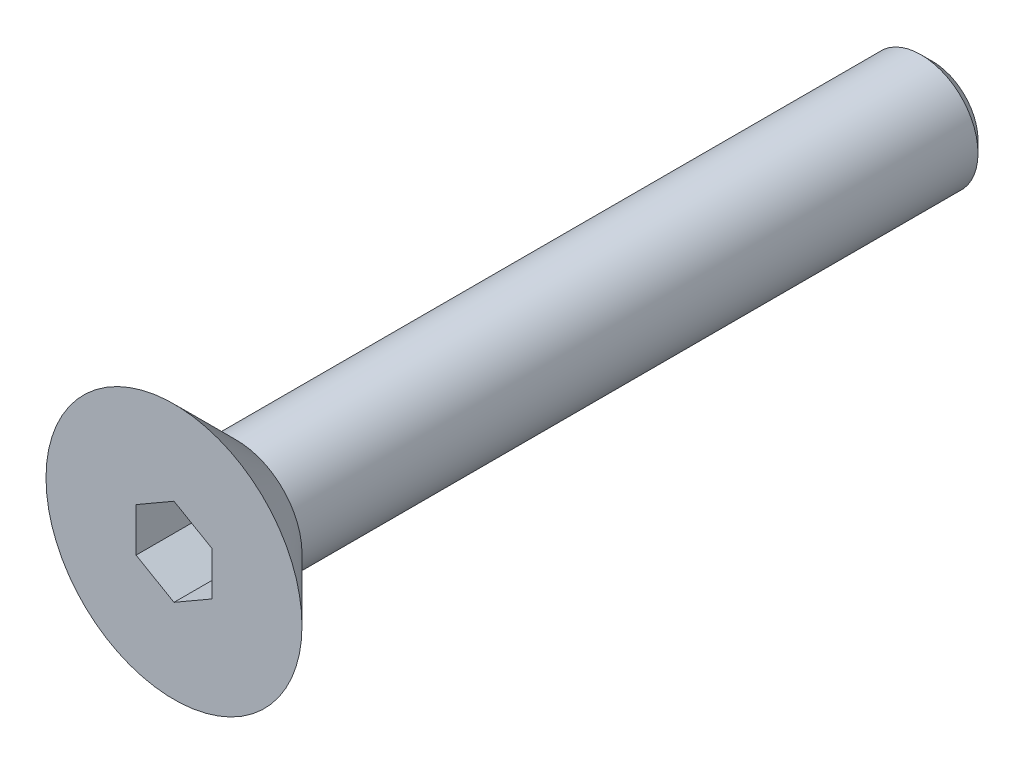
ISO-10303-21;
HEADER;
FILE_DESCRIPTION(('STEP AP214'),'2;1');
FILE_NAME('part.step','',(''),(''),'','','');
FILE_SCHEMA(('AUTOMOTIVE_DESIGN { 1 0 10303 214 1 1 1 1 }'));
ENDSEC;
DATA;
#1=APPLICATION_CONTEXT('core data for automotive mechanical design processes');
#2=APPLICATION_PROTOCOL_DEFINITION('international standard','automotive_design',2000,#1);
#3=PRODUCT_CONTEXT('',#1,'mechanical');
#4=PRODUCT('Part','Part','',(#3));
#5=PRODUCT_RELATED_PRODUCT_CATEGORY('part','',(#4));
#6=PRODUCT_DEFINITION_FORMATION('','',#4);
#7=PRODUCT_DEFINITION_CONTEXT('part definition',#1,'design');
#8=PRODUCT_DEFINITION('design','',#6,#7);
#9=PRODUCT_DEFINITION_SHAPE('','',#8);
#10=(LENGTH_UNIT() NAMED_UNIT(*) SI_UNIT(.MILLI.,.METRE.));
#11=(NAMED_UNIT(*) PLANE_ANGLE_UNIT() SI_UNIT($,.RADIAN.));
#12=(NAMED_UNIT(*) SI_UNIT($,.STERADIAN.) SOLID_ANGLE_UNIT());
#13=UNCERTAINTY_MEASURE_WITH_UNIT(LENGTH_MEASURE(1.E-05),#10,'distance_accuracy_value','');
#14=(GEOMETRIC_REPRESENTATION_CONTEXT(3) GLOBAL_UNCERTAINTY_ASSIGNED_CONTEXT((#13)) GLOBAL_UNIT_ASSIGNED_CONTEXT((#10,
#11,#12)) REPRESENTATION_CONTEXT('',''));
#15=CARTESIAN_POINT('',(0.,0.,0.));
#16=DIRECTION('',(0.,0.,1.));
#17=DIRECTION('',(1.,0.,0.));
#18=AXIS2_PLACEMENT_3D('',#15,#16,#17);
#19=CARTESIAN_POINT('',(0.,0.,0.));
#20=DIRECTION('',(0.,0.,1.));
#21=DIRECTION('',(1.,0.,0.));
#22=AXIS2_PLACEMENT_3D('',#19,#20,#21);
#23=PLANE('',#22);
#24=CARTESIAN_POINT('',(0.,0.,0.));
#25=DIRECTION('',(0.,0.,1.));
#26=DIRECTION('',(1.,0.,0.));
#27=AXIS2_PLACEMENT_3D('',#24,#25,#26);
#28=CIRCLE('',#27,1.725);
#29=CARTESIAN_POINT('',(1.725,0.,0.));
#30=VERTEX_POINT('',#29);
#31=EDGE_CURVE('E11',#30,#30,#28,.F.);
#32=ORIENTED_EDGE('',*,*,#31,.T.);
#33=EDGE_LOOP('',(#32));
#34=FACE_BOUND('',#33,.T.);
#35=CARTESIAN_POINT('',(0.,0.,0.));
#36=DIRECTION('',(0.,0.,1.));
#37=DIRECTION('',(1.,0.,0.));
#38=AXIS2_PLACEMENT_3D('',#35,#36,#37);
#39=CIRCLE('',#38,1.5);
#40=CARTESIAN_POINT('',(1.5,0.,0.));
#41=VERTEX_POINT('',#40);
#42=EDGE_CURVE('E144',#41,#41,#39,.F.);
#43=ORIENTED_EDGE('',*,*,#42,.F.);
#44=EDGE_LOOP('',(#43));
#45=FACE_BOUND('',#44,.T.);
#46=ADVANCED_FACE('F34',(#34,#45),#23,.F.);
#47=CARTESIAN_POINT('',(0.,0.,1.65));
#48=DIRECTION('',(0.,0.,1.));
#49=DIRECTION('',(1.,0.,0.));
#50=AXIS2_PLACEMENT_3D('',#47,#48,#49);
#51=PLANE('',#50);
#52=DIRECTION('',(-0.866025403784439,0.5,0.));
#53=VECTOR('',#52,1.);
#54=CARTESIAN_POINT('',(1.,0.577350269189626,1.65));
#55=LINE('',#54,#53);
#56=CARTESIAN_POINT('',(1.,0.577350269189626,1.65));
#57=VERTEX_POINT('',#56);
#58=CARTESIAN_POINT('',(0.,1.15470053837925,1.65));
#59=VERTEX_POINT('',#58);
#60=EDGE_CURVE('E49',#57,#59,#55,.T.);
#61=ORIENTED_EDGE('',*,*,#60,.F.);
#62=DIRECTION('',(0.,1.,0.));
#63=VECTOR('',#62,1.);
#64=CARTESIAN_POINT('',(1.,-0.577350269189626,1.65));
#65=LINE('',#64,#63);
#66=CARTESIAN_POINT('',(1.,-0.577350269189626,1.65));
#67=VERTEX_POINT('',#66);
#68=EDGE_CURVE('E132',#67,#57,#65,.T.);
#69=ORIENTED_EDGE('',*,*,#68,.F.);
#70=DIRECTION('',(0.866025403784439,0.5,0.));
#71=VECTOR('',#70,1.);
#72=CARTESIAN_POINT('',(0.,-1.15470053837925,1.65));
#73=LINE('',#72,#71);
#74=CARTESIAN_POINT('',(0.,-1.15470053837925,1.65));
#75=VERTEX_POINT('',#74);
#76=EDGE_CURVE('E130',#75,#67,#73,.T.);
#77=ORIENTED_EDGE('',*,*,#76,.F.);
#78=DIRECTION('',(0.866025403784439,-0.5,0.));
#79=VECTOR('',#78,1.);
#80=CARTESIAN_POINT('',(-1.,-0.577350269189626,1.65));
#81=LINE('',#80,#79);
#82=CARTESIAN_POINT('',(-1.,-0.577350269189626,1.65));
#83=VERTEX_POINT('',#82);
#84=EDGE_CURVE('E97',#83,#75,#81,.T.);
#85=ORIENTED_EDGE('',*,*,#84,.F.);
#86=DIRECTION('',(0.,-1.,0.));
#87=VECTOR('',#86,1.);
#88=CARTESIAN_POINT('',(-1.,0.577350269189626,1.65));
#89=LINE('',#88,#87);
#90=CARTESIAN_POINT('',(-1.,0.577350269189626,1.65));
#91=VERTEX_POINT('',#90);
#92=EDGE_CURVE('E126',#91,#83,#89,.T.);
#93=ORIENTED_EDGE('',*,*,#92,.F.);
#94=DIRECTION('',(-0.866025403784439,-0.5,0.));
#95=VECTOR('',#94,1.);
#96=CARTESIAN_POINT('',(0.,1.15470053837925,1.65));
#97=LINE('',#96,#95);
#98=EDGE_CURVE('E123',#59,#91,#97,.T.);
#99=ORIENTED_EDGE('',*,*,#98,.F.);
#100=EDGE_LOOP('',(#61,#69,#77,#85,#93,#99));
#101=FACE_BOUND('',#100,.T.);
#102=CARTESIAN_POINT('',(0.,0.,1.65));
#103=DIRECTION('',(0.,0.,1.));
#104=DIRECTION('',(1.,0.,0.));
#105=AXIS2_PLACEMENT_3D('',#102,#103,#104);
#106=CIRCLE('',#105,3.375);
#107=CARTESIAN_POINT('',(3.375,0.,1.65));
#108=VERTEX_POINT('',#107);
#109=EDGE_CURVE('E136',#108,#108,#106,.T.);
#110=ORIENTED_EDGE('',*,*,#109,.T.);
#111=EDGE_LOOP('',(#110));
#112=FACE_BOUND('',#111,.T.);
#113=ADVANCED_FACE('F167',(#101,#112),#51,.T.);
#114=CARTESIAN_POINT('',(0.,0.,-18.35));
#115=DIRECTION('',(0.,0.,1.));
#116=DIRECTION('',(1.,0.,0.));
#117=AXIS2_PLACEMENT_3D('',#114,#115,#116);
#118=CYLINDRICAL_SURFACE('',#117,1.5);
#119=CARTESIAN_POINT('',(0.,0.,-18.05));
#120=DIRECTION('',(0.,0.,-1.));
#121=DIRECTION('',(-1.,0.,0.));
#122=AXIS2_PLACEMENT_3D('',#119,#120,#121);
#123=CIRCLE('',#122,1.5);
#124=CARTESIAN_POINT('',(-1.5,0.,-18.05));
#125=VERTEX_POINT('',#124);
#126=EDGE_CURVE('E42',#125,#125,#123,.F.);
#127=ORIENTED_EDGE('',*,*,#126,.T.);
#128=EDGE_LOOP('',(#127));
#129=FACE_BOUND('',#128,.T.);
#130=ORIENTED_EDGE('',*,*,#42,.T.);
#131=EDGE_LOOP('',(#130));
#132=FACE_BOUND('',#131,.T.);
#133=ADVANCED_FACE('F152',(#129,#132),#118,.T.);
#134=CARTESIAN_POINT('',(0.,0.,-18.35));
#135=DIRECTION('',(0.,0.,-1.));
#136=DIRECTION('',(-1.,0.,0.));
#137=AXIS2_PLACEMENT_3D('',#134,#135,#136);
#138=PLANE('',#137);
#139=CARTESIAN_POINT('',(0.,0.,-18.35));
#140=DIRECTION('',(0.,0.,-1.));
#141=DIRECTION('',(-1.,0.,0.));
#142=AXIS2_PLACEMENT_3D('',#139,#140,#141);
#143=CIRCLE('',#142,1.2);
#144=CARTESIAN_POINT('',(-1.2,0.,-18.35));
#145=VERTEX_POINT('',#144);
#146=EDGE_CURVE('E147',#145,#145,#143,.T.);
#147=ORIENTED_EDGE('',*,*,#146,.T.);
#148=EDGE_LOOP('',(#147));
#149=FACE_BOUND('',#148,.T.);
#150=ADVANCED_FACE('F159',(#149),#138,.T.);
#151=CARTESIAN_POINT('',(0.,0.,-18.35));
#152=DIRECTION('',(0.,0.,1.));
#153=DIRECTION('',(1.,0.,0.));
#154=AXIS2_PLACEMENT_3D('',#151,#152,#153);
#155=CONICAL_SURFACE('',#154,1.2,0.785398163397447);
#156=ORIENTED_EDGE('',*,*,#126,.F.);
#157=EDGE_LOOP('',(#156));
#158=FACE_BOUND('',#157,.T.);
#159=ORIENTED_EDGE('',*,*,#146,.F.);
#160=EDGE_LOOP('',(#159));
#161=FACE_BOUND('',#160,.T.);
#162=ADVANCED_FACE('F155',(#158,#161),#155,.T.);
#163=CARTESIAN_POINT('',(1.,0.577350269189626,-0.35));
#164=DIRECTION('',(0.5,0.866025403784439,0.));
#165=DIRECTION('',(-0.866025403784439,0.5,0.));
#166=AXIS2_PLACEMENT_3D('',#163,#164,#165);
#167=PLANE('',#166);
#168=ORIENTED_EDGE('',*,*,#60,.T.);
#169=DIRECTION('',(0.,0.,1.));
#170=VECTOR('',#169,1.);
#171=CARTESIAN_POINT('',(0.,1.15470053837925,-0.35));
#172=LINE('',#171,#170);
#173=CARTESIAN_POINT('',(0.,1.15470053837925,-0.35));
#174=VERTEX_POINT('',#173);
#175=EDGE_CURVE('E79',#174,#59,#172,.T.);
#176=ORIENTED_EDGE('',*,*,#175,.F.);
#177=DIRECTION('',(-0.866025403784439,0.5,0.));
#178=VECTOR('',#177,1.);
#179=CARTESIAN_POINT('',(1.,0.577350269189626,-0.35));
#180=LINE('',#179,#178);
#181=CARTESIAN_POINT('',(1.,0.577350269189626,-0.35));
#182=VERTEX_POINT('',#181);
#183=EDGE_CURVE('E134',#182,#174,#180,.T.);
#184=ORIENTED_EDGE('',*,*,#183,.F.);
#185=DIRECTION('',(0.,0.,1.));
#186=VECTOR('',#185,1.);
#187=CARTESIAN_POINT('',(1.,0.577350269189626,-0.35));
#188=LINE('',#187,#186);
#189=EDGE_CURVE('E57',#182,#57,#188,.T.);
#190=ORIENTED_EDGE('',*,*,#189,.T.);
#191=EDGE_LOOP('',(#168,#176,#184,#190));
#192=FACE_BOUND('',#191,.T.);
#193=ADVANCED_FACE('F158',(#192),#167,.F.);
#194=CARTESIAN_POINT('',(1.,-0.577350269189626,-0.35));
#195=DIRECTION('',(1.,0.,0.));
#196=DIRECTION('',(0.,1.,0.));
#197=AXIS2_PLACEMENT_3D('',#194,#195,#196);
#198=PLANE('',#197);
#199=ORIENTED_EDGE('',*,*,#68,.T.);
#200=ORIENTED_EDGE('',*,*,#189,.F.);
#201=DIRECTION('',(0.,1.,0.));
#202=VECTOR('',#201,1.);
#203=CARTESIAN_POINT('',(1.,-0.577350269189626,-0.35));
#204=LINE('',#203,#202);
#205=CARTESIAN_POINT('',(1.,-0.577350269189626,-0.35));
#206=VERTEX_POINT('',#205);
#207=EDGE_CURVE('E109',#206,#182,#204,.T.);
#208=ORIENTED_EDGE('',*,*,#207,.F.);
#209=DIRECTION('',(0.,0.,1.));
#210=VECTOR('',#209,1.);
#211=CARTESIAN_POINT('',(1.,-0.577350269189626,-0.35));
#212=LINE('',#211,#210);
#213=EDGE_CURVE('E101',#206,#67,#212,.T.);
#214=ORIENTED_EDGE('',*,*,#213,.T.);
#215=EDGE_LOOP('',(#199,#200,#208,#214));
#216=FACE_BOUND('',#215,.T.);
#217=ADVANCED_FACE('F198',(#216),#198,.F.);
#218=CARTESIAN_POINT('',(0.,-1.15470053837925,-0.35));
#219=DIRECTION('',(0.5,-0.866025403784439,0.));
#220=DIRECTION('',(0.866025403784439,0.5,0.));
#221=AXIS2_PLACEMENT_3D('',#218,#219,#220);
#222=PLANE('',#221);
#223=ORIENTED_EDGE('',*,*,#76,.T.);
#224=ORIENTED_EDGE('',*,*,#213,.F.);
#225=DIRECTION('',(0.866025403784439,0.5,0.));
#226=VECTOR('',#225,1.);
#227=CARTESIAN_POINT('',(0.,-1.15470053837925,-0.35));
#228=LINE('',#227,#226);
#229=CARTESIAN_POINT('',(0.,-1.15470053837925,-0.35));
#230=VERTEX_POINT('',#229);
#231=EDGE_CURVE('E105',#230,#206,#228,.T.);
#232=ORIENTED_EDGE('',*,*,#231,.F.);
#233=DIRECTION('',(0.,0.,1.));
#234=VECTOR('',#233,1.);
#235=CARTESIAN_POINT('',(0.,-1.15470053837925,-0.35));
#236=LINE('',#235,#234);
#237=EDGE_CURVE('E90',#230,#75,#236,.T.);
#238=ORIENTED_EDGE('',*,*,#237,.T.);
#239=EDGE_LOOP('',(#223,#224,#232,#238));
#240=FACE_BOUND('',#239,.T.);
#241=ADVANCED_FACE('F106',(#240),#222,.F.);
#242=CARTESIAN_POINT('',(-1.,-0.577350269189626,-0.35));
#243=DIRECTION('',(-0.5,-0.866025403784439,0.));
#244=DIRECTION('',(0.866025403784439,-0.5,0.));
#245=AXIS2_PLACEMENT_3D('',#242,#243,#244);
#246=PLANE('',#245);
#247=ORIENTED_EDGE('',*,*,#84,.T.);
#248=ORIENTED_EDGE('',*,*,#237,.F.);
#249=DIRECTION('',(0.866025403784439,-0.5,0.));
#250=VECTOR('',#249,1.);
#251=CARTESIAN_POINT('',(-1.,-0.577350269189626,-0.35));
#252=LINE('',#251,#250);
#253=CARTESIAN_POINT('',(-1.,-0.577350269189626,-0.35));
#254=VERTEX_POINT('',#253);
#255=EDGE_CURVE('E94',#254,#230,#252,.T.);
#256=ORIENTED_EDGE('',*,*,#255,.F.);
#257=DIRECTION('',(0.,0.,1.));
#258=VECTOR('',#257,1.);
#259=CARTESIAN_POINT('',(-1.,-0.577350269189626,-0.35));
#260=LINE('',#259,#258);
#261=EDGE_CURVE('E102',#254,#83,#260,.T.);
#262=ORIENTED_EDGE('',*,*,#261,.T.);
#263=EDGE_LOOP('',(#247,#248,#256,#262));
#264=FACE_BOUND('',#263,.T.);
#265=ADVANCED_FACE('F92',(#264),#246,.F.);
#266=CARTESIAN_POINT('',(-1.,0.577350269189626,-0.35));
#267=DIRECTION('',(-1.,0.,0.));
#268=DIRECTION('',(0.,-1.,0.));
#269=AXIS2_PLACEMENT_3D('',#266,#267,#268);
#270=PLANE('',#269);
#271=ORIENTED_EDGE('',*,*,#92,.T.);
#272=ORIENTED_EDGE('',*,*,#261,.F.);
#273=DIRECTION('',(0.,-1.,0.));
#274=VECTOR('',#273,1.);
#275=CARTESIAN_POINT('',(-1.,0.577350269189626,-0.35));
#276=LINE('',#275,#274);
#277=CARTESIAN_POINT('',(-1.,0.577350269189626,-0.35));
#278=VERTEX_POINT('',#277);
#279=EDGE_CURVE('E115',#278,#254,#276,.T.);
#280=ORIENTED_EDGE('',*,*,#279,.F.);
#281=DIRECTION('',(0.,0.,1.));
#282=VECTOR('',#281,1.);
#283=CARTESIAN_POINT('',(-1.,0.577350269189626,-0.35));
#284=LINE('',#283,#282);
#285=EDGE_CURVE('E139',#278,#91,#284,.T.);
#286=ORIENTED_EDGE('',*,*,#285,.T.);
#287=EDGE_LOOP('',(#271,#272,#280,#286));
#288=FACE_BOUND('',#287,.T.);
#289=ADVANCED_FACE('F194',(#288),#270,.F.);
#290=CARTESIAN_POINT('',(0.,1.15470053837925,-0.35));
#291=DIRECTION('',(-0.5,0.866025403784439,0.));
#292=DIRECTION('',(-0.866025403784439,-0.5,0.));
#293=AXIS2_PLACEMENT_3D('',#290,#291,#292);
#294=PLANE('',#293);
#295=ORIENTED_EDGE('',*,*,#98,.T.);
#296=ORIENTED_EDGE('',*,*,#285,.F.);
#297=DIRECTION('',(-0.866025403784439,-0.5,0.));
#298=VECTOR('',#297,1.);
#299=CARTESIAN_POINT('',(0.,1.15470053837925,-0.35));
#300=LINE('',#299,#298);
#301=EDGE_CURVE('E117',#174,#278,#300,.T.);
#302=ORIENTED_EDGE('',*,*,#301,.F.);
#303=ORIENTED_EDGE('',*,*,#175,.T.);
#304=EDGE_LOOP('',(#295,#296,#302,#303));
#305=FACE_BOUND('',#304,.T.);
#306=ADVANCED_FACE('F189',(#305),#294,.F.);
#307=CARTESIAN_POINT('',(0.,0.,-0.35));
#308=DIRECTION('',(0.,0.,1.));
#309=DIRECTION('',(1.,0.,0.));
#310=AXIS2_PLACEMENT_3D('',#307,#308,#309);
#311=PLANE('',#310);
#312=ORIENTED_EDGE('',*,*,#183,.T.);
#313=ORIENTED_EDGE('',*,*,#301,.T.);
#314=ORIENTED_EDGE('',*,*,#279,.T.);
#315=ORIENTED_EDGE('',*,*,#255,.T.);
#316=ORIENTED_EDGE('',*,*,#231,.T.);
#317=ORIENTED_EDGE('',*,*,#207,.T.);
#318=EDGE_LOOP('',(#312,#313,#314,#315,#316,#317));
#319=FACE_BOUND('',#318,.T.);
#320=ADVANCED_FACE('F112',(#319),#311,.T.);
#321=CARTESIAN_POINT('',(0.,0.,1.65));
#322=DIRECTION('',(0.,0.,1.));
#323=DIRECTION('',(1.,0.,0.));
#324=AXIS2_PLACEMENT_3D('',#321,#322,#323);
#325=CONICAL_SURFACE('',#324,3.375,0.78539816339745);
#326=ORIENTED_EDGE('',*,*,#31,.F.);
#327=EDGE_LOOP('',(#326));
#328=FACE_BOUND('',#327,.T.);
#329=ORIENTED_EDGE('',*,*,#109,.F.);
#330=EDGE_LOOP('',(#329));
#331=FACE_BOUND('',#330,.T.);
#332=ADVANCED_FACE('F36',(#328,#331),#325,.T.);
#333=CLOSED_SHELL('',(#46,#113,#133,#150,#162,#193,#217,#241,#265,#289,#306,#320,#332));
#334=MANIFOLD_SOLID_BREP('B2',#333);
#335=ADVANCED_BREP_SHAPE_REPRESENTATION('',(#18,#334),#14);
#336=SHAPE_DEFINITION_REPRESENTATION(#9,#335);
ENDSEC;
END-ISO-10303-21;
